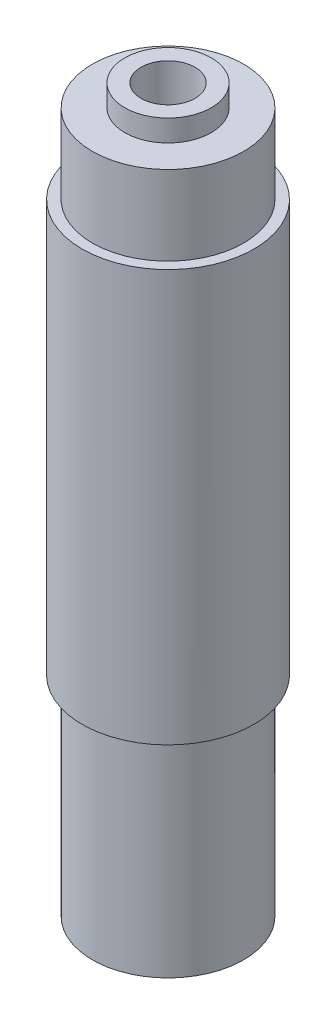
ISO-10303-21;
HEADER;
FILE_DESCRIPTION(('STEP AP214'),'2;1');
FILE_NAME('part.step','',(''),(''),'','','');
FILE_SCHEMA(('AUTOMOTIVE_DESIGN { 1 0 10303 214 1 1 1 1 }'));
ENDSEC;
DATA;
#1=APPLICATION_CONTEXT('core data for automotive mechanical design processes');
#2=APPLICATION_PROTOCOL_DEFINITION('international standard','automotive_design',2000,#1);
#3=PRODUCT_CONTEXT('',#1,'mechanical');
#4=PRODUCT('Part','Part','',(#3));
#5=PRODUCT_RELATED_PRODUCT_CATEGORY('part','',(#4));
#6=PRODUCT_DEFINITION_FORMATION('','',#4);
#7=PRODUCT_DEFINITION_CONTEXT('part definition',#1,'design');
#8=PRODUCT_DEFINITION('design','',#6,#7);
#9=PRODUCT_DEFINITION_SHAPE('','',#8);
#10=(LENGTH_UNIT() NAMED_UNIT(*) SI_UNIT(.MILLI.,.METRE.));
#11=(NAMED_UNIT(*) PLANE_ANGLE_UNIT() SI_UNIT($,.RADIAN.));
#12=(NAMED_UNIT(*) SI_UNIT($,.STERADIAN.) SOLID_ANGLE_UNIT());
#13=UNCERTAINTY_MEASURE_WITH_UNIT(LENGTH_MEASURE(1.E-05),#10,'distance_accuracy_value','');
#14=(GEOMETRIC_REPRESENTATION_CONTEXT(3) GLOBAL_UNCERTAINTY_ASSIGNED_CONTEXT((#13)) GLOBAL_UNIT_ASSIGNED_CONTEXT((#10,
#11,#12)) REPRESENTATION_CONTEXT('',''));
#15=CARTESIAN_POINT('',(0.,0.,0.));
#16=DIRECTION('',(0.,0.,1.));
#17=DIRECTION('',(1.,0.,0.));
#18=AXIS2_PLACEMENT_3D('',#15,#16,#17);
#19=CARTESIAN_POINT('',(0.,-17.2,0.));
#20=DIRECTION('',(0.,1.,0.));
#21=DIRECTION('',(0.,0.,1.));
#22=AXIS2_PLACEMENT_3D('',#19,#20,#21);
#23=PLANE('',#22);
#24=CARTESIAN_POINT('',(0.,-17.2,0.));
#25=DIRECTION('',(0.,1.,0.));
#26=DIRECTION('',(0.,0.,1.));
#27=AXIS2_PLACEMENT_3D('',#24,#25,#26);
#28=CIRCLE('',#27,1.24999999999999);
#29=CARTESIAN_POINT('',(0.,-17.2,1.24999999999999));
#30=VERTEX_POINT('',#29);
#31=EDGE_CURVE('E10',#30,#30,#28,.T.);
#32=ORIENTED_EDGE('',*,*,#31,.T.);
#33=EDGE_LOOP('',(#32));
#34=FACE_BOUND('',#33,.T.);
#35=CARTESIAN_POINT('',(0.,-17.2,0.));
#36=DIRECTION('',(0.,-1.,0.));
#37=DIRECTION('',(0.,0.,-1.));
#38=AXIS2_PLACEMENT_3D('',#35,#36,#37);
#39=CIRCLE('',#38,2.);
#40=CARTESIAN_POINT('',(0.,-17.2,-2.));
#41=VERTEX_POINT('',#40);
#42=EDGE_CURVE('E76',#41,#41,#39,.T.);
#43=ORIENTED_EDGE('',*,*,#42,.T.);
#44=EDGE_LOOP('',(#43));
#45=FACE_BOUND('',#44,.T.);
#46=ADVANCED_FACE('F37',(#34,#45),#23,.F.);
#47=CARTESIAN_POINT('',(0.,-6.525,0.));
#48=DIRECTION('',(0.,-1.,0.));
#49=DIRECTION('',(0.,0.,-1.));
#50=AXIS2_PLACEMENT_3D('',#47,#48,#49);
#51=CYLINDRICAL_SURFACE('',#50,3.5);
#52=CARTESIAN_POINT('',(0.,-6.525,0.));
#53=DIRECTION('',(0.,-1.,0.));
#54=DIRECTION('',(0.,0.,-1.));
#55=AXIS2_PLACEMENT_3D('',#52,#53,#54);
#56=CIRCLE('',#55,3.5);
#57=CARTESIAN_POINT('',(0.,-6.525,-3.5));
#58=VERTEX_POINT('',#57);
#59=EDGE_CURVE('E69',#58,#58,#56,.T.);
#60=ORIENTED_EDGE('',*,*,#59,.T.);
#61=EDGE_LOOP('',(#60));
#62=FACE_BOUND('',#61,.T.);
#63=CARTESIAN_POINT('',(0.,-16.2,0.));
#64=DIRECTION('',(0.,-1.,0.));
#65=DIRECTION('',(0.,0.,-1.));
#66=AXIS2_PLACEMENT_3D('',#63,#64,#65);
#67=CIRCLE('',#66,3.5);
#68=CARTESIAN_POINT('',(0.,-16.2,-3.5));
#69=VERTEX_POINT('',#68);
#70=EDGE_CURVE('E72',#69,#69,#67,.T.);
#71=ORIENTED_EDGE('',*,*,#70,.F.);
#72=EDGE_LOOP('',(#71));
#73=FACE_BOUND('',#72,.T.);
#74=ADVANCED_FACE('F92',(#62,#73),#51,.T.);
#75=CARTESIAN_POINT('',(0.,17.2,0.));
#76=DIRECTION('',(0.,-1.,0.));
#77=DIRECTION('',(0.,0.,-1.));
#78=AXIS2_PLACEMENT_3D('',#75,#76,#77);
#79=CYLINDRICAL_SURFACE('',#78,3.9751);
#80=CARTESIAN_POINT('',(0.,12.525,0.));
#81=DIRECTION('',(0.,1.,0.));
#82=DIRECTION('',(0.,0.,1.));
#83=AXIS2_PLACEMENT_3D('',#80,#81,#82);
#84=CIRCLE('',#83,3.9751);
#85=CARTESIAN_POINT('',(0.,12.525,3.9751));
#86=VERTEX_POINT('',#85);
#87=EDGE_CURVE('E48',#86,#86,#84,.T.);
#88=ORIENTED_EDGE('',*,*,#87,.F.);
#89=EDGE_LOOP('',(#88));
#90=FACE_BOUND('',#89,.T.);
#91=CARTESIAN_POINT('',(0.,-6.525,0.));
#92=DIRECTION('',(0.,-1.,0.));
#93=DIRECTION('',(0.,0.,-1.));
#94=AXIS2_PLACEMENT_3D('',#91,#92,#93);
#95=CIRCLE('',#94,3.9751);
#96=CARTESIAN_POINT('',(0.,-6.525,-3.9751));
#97=VERTEX_POINT('',#96);
#98=EDGE_CURVE('E62',#97,#97,#95,.T.);
#99=ORIENTED_EDGE('',*,*,#98,.F.);
#100=EDGE_LOOP('',(#99));
#101=FACE_BOUND('',#100,.T.);
#102=ADVANCED_FACE('F39',(#90,#101),#79,.T.);
#103=CARTESIAN_POINT('',(0.,17.2,0.));
#104=DIRECTION('',(0.,1.,0.));
#105=DIRECTION('',(0.,0.,1.));
#106=AXIS2_PLACEMENT_3D('',#103,#104,#105);
#107=PLANE('',#106);
#108=CARTESIAN_POINT('',(0.,17.2,0.));
#109=DIRECTION('',(0.,1.,0.));
#110=DIRECTION('',(0.,0.,1.));
#111=AXIS2_PLACEMENT_3D('',#108,#109,#110);
#112=CIRCLE('',#111,1.25);
#113=CARTESIAN_POINT('',(0.,17.2,1.25));
#114=VERTEX_POINT('',#113);
#115=EDGE_CURVE('E44',#114,#114,#112,.T.);
#116=ORIENTED_EDGE('',*,*,#115,.F.);
#117=EDGE_LOOP('',(#116));
#118=FACE_BOUND('',#117,.T.);
#119=CARTESIAN_POINT('',(0.,17.2,0.));
#120=DIRECTION('',(0.,1.,0.));
#121=DIRECTION('',(0.,0.,1.));
#122=AXIS2_PLACEMENT_3D('',#119,#120,#121);
#123=CIRCLE('',#122,2.);
#124=CARTESIAN_POINT('',(0.,17.2,2.));
#125=VERTEX_POINT('',#124);
#126=EDGE_CURVE('E58',#125,#125,#123,.T.);
#127=ORIENTED_EDGE('',*,*,#126,.T.);
#128=EDGE_LOOP('',(#127));
#129=FACE_BOUND('',#128,.T.);
#130=ADVANCED_FACE('F100',(#118,#129),#107,.T.);
#131=CARTESIAN_POINT('',(0.,12.525,0.));
#132=DIRECTION('',(0.,1.,0.));
#133=DIRECTION('',(0.,0.,1.));
#134=AXIS2_PLACEMENT_3D('',#131,#132,#133);
#135=CYLINDRICAL_SURFACE('',#134,3.5);
#136=CARTESIAN_POINT('',(0.,12.525,0.));
#137=DIRECTION('',(0.,1.,0.));
#138=DIRECTION('',(0.,0.,1.));
#139=AXIS2_PLACEMENT_3D('',#136,#137,#138);
#140=CIRCLE('',#139,3.5);
#141=CARTESIAN_POINT('',(0.,12.525,3.5));
#142=VERTEX_POINT('',#141);
#143=EDGE_CURVE('E52',#142,#142,#140,.T.);
#144=ORIENTED_EDGE('',*,*,#143,.T.);
#145=EDGE_LOOP('',(#144));
#146=FACE_BOUND('',#145,.T.);
#147=CARTESIAN_POINT('',(0.,16.2,0.));
#148=DIRECTION('',(0.,1.,0.));
#149=DIRECTION('',(0.,0.,1.));
#150=AXIS2_PLACEMENT_3D('',#147,#148,#149);
#151=CIRCLE('',#150,3.5);
#152=CARTESIAN_POINT('',(0.,16.2,3.5));
#153=VERTEX_POINT('',#152);
#154=EDGE_CURVE('E57',#153,#153,#151,.T.);
#155=ORIENTED_EDGE('',*,*,#154,.F.);
#156=EDGE_LOOP('',(#155));
#157=FACE_BOUND('',#156,.T.);
#158=ADVANCED_FACE('F113',(#146,#157),#135,.T.);
#159=CARTESIAN_POINT('',(0.,17.2,0.));
#160=DIRECTION('',(0.,1.,0.));
#161=DIRECTION('',(0.,0.,1.));
#162=AXIS2_PLACEMENT_3D('',#159,#160,#161);
#163=CYLINDRICAL_SURFACE('',#162,1.24999999999999);
#164=ORIENTED_EDGE('',*,*,#31,.F.);
#165=EDGE_LOOP('',(#164));
#166=FACE_BOUND('',#165,.T.);
#167=ORIENTED_EDGE('',*,*,#115,.T.);
#168=EDGE_LOOP('',(#167));
#169=FACE_BOUND('',#168,.T.);
#170=ADVANCED_FACE('F116',(#166,#169),#163,.F.);
#171=CARTESIAN_POINT('',(0.,12.525,0.));
#172=DIRECTION('',(0.,1.,0.));
#173=DIRECTION('',(0.,0.,1.));
#174=AXIS2_PLACEMENT_3D('',#171,#172,#173);
#175=PLANE('',#174);
#176=ORIENTED_EDGE('',*,*,#143,.F.);
#177=EDGE_LOOP('',(#176));
#178=FACE_BOUND('',#177,.T.);
#179=ORIENTED_EDGE('',*,*,#87,.T.);
#180=EDGE_LOOP('',(#179));
#181=FACE_BOUND('',#180,.T.);
#182=ADVANCED_FACE('F111',(#178,#181),#175,.T.);
#183=CARTESIAN_POINT('',(0.,16.2,0.));
#184=DIRECTION('',(0.,1.,0.));
#185=DIRECTION('',(0.,0.,1.));
#186=AXIS2_PLACEMENT_3D('',#183,#184,#185);
#187=CYLINDRICAL_SURFACE('',#186,2.);
#188=CARTESIAN_POINT('',(0.,16.2,0.));
#189=DIRECTION('',(0.,1.,0.));
#190=DIRECTION('',(0.,0.,1.));
#191=AXIS2_PLACEMENT_3D('',#188,#189,#190);
#192=CIRCLE('',#191,2.);
#193=CARTESIAN_POINT('',(0.,16.2,2.));
#194=VERTEX_POINT('',#193);
#195=EDGE_CURVE('E61',#194,#194,#192,.T.);
#196=ORIENTED_EDGE('',*,*,#195,.T.);
#197=EDGE_LOOP('',(#196));
#198=FACE_BOUND('',#197,.T.);
#199=ORIENTED_EDGE('',*,*,#126,.F.);
#200=EDGE_LOOP('',(#199));
#201=FACE_BOUND('',#200,.T.);
#202=ADVANCED_FACE('F107',(#198,#201),#187,.T.);
#203=CARTESIAN_POINT('',(0.,16.2,0.));
#204=DIRECTION('',(0.,1.,0.));
#205=DIRECTION('',(0.,0.,1.));
#206=AXIS2_PLACEMENT_3D('',#203,#204,#205);
#207=PLANE('',#206);
#208=ORIENTED_EDGE('',*,*,#195,.F.);
#209=EDGE_LOOP('',(#208));
#210=FACE_BOUND('',#209,.T.);
#211=ORIENTED_EDGE('',*,*,#154,.T.);
#212=EDGE_LOOP('',(#211));
#213=FACE_BOUND('',#212,.T.);
#214=ADVANCED_FACE('F104',(#210,#213),#207,.T.);
#215=CARTESIAN_POINT('',(0.,-6.525,0.));
#216=DIRECTION('',(0.,-1.,0.));
#217=DIRECTION('',(0.,0.,-1.));
#218=AXIS2_PLACEMENT_3D('',#215,#216,#217);
#219=PLANE('',#218);
#220=ORIENTED_EDGE('',*,*,#59,.F.);
#221=EDGE_LOOP('',(#220));
#222=FACE_BOUND('',#221,.T.);
#223=ORIENTED_EDGE('',*,*,#98,.T.);
#224=EDGE_LOOP('',(#223));
#225=FACE_BOUND('',#224,.T.);
#226=ADVANCED_FACE('F88',(#222,#225),#219,.T.);
#227=CARTESIAN_POINT('',(0.,-16.2,0.));
#228=DIRECTION('',(0.,-1.,0.));
#229=DIRECTION('',(0.,0.,-1.));
#230=AXIS2_PLACEMENT_3D('',#227,#228,#229);
#231=PLANE('',#230);
#232=CARTESIAN_POINT('',(0.,-16.2,0.));
#233=DIRECTION('',(0.,-1.,0.));
#234=DIRECTION('',(0.,0.,-1.));
#235=AXIS2_PLACEMENT_3D('',#232,#233,#234);
#236=CIRCLE('',#235,2.);
#237=CARTESIAN_POINT('',(0.,-16.2,-2.));
#238=VERTEX_POINT('',#237);
#239=EDGE_CURVE('E75',#238,#238,#236,.T.);
#240=ORIENTED_EDGE('',*,*,#239,.F.);
#241=EDGE_LOOP('',(#240));
#242=FACE_BOUND('',#241,.T.);
#243=ORIENTED_EDGE('',*,*,#70,.T.);
#244=EDGE_LOOP('',(#243));
#245=FACE_BOUND('',#244,.T.);
#246=ADVANCED_FACE('F85',(#242,#245),#231,.T.);
#247=CARTESIAN_POINT('',(0.,-16.2,0.));
#248=DIRECTION('',(0.,-1.,0.));
#249=DIRECTION('',(0.,0.,-1.));
#250=AXIS2_PLACEMENT_3D('',#247,#248,#249);
#251=CYLINDRICAL_SURFACE('',#250,2.);
#252=ORIENTED_EDGE('',*,*,#239,.T.);
#253=EDGE_LOOP('',(#252));
#254=FACE_BOUND('',#253,.T.);
#255=ORIENTED_EDGE('',*,*,#42,.F.);
#256=EDGE_LOOP('',(#255));
#257=FACE_BOUND('',#256,.T.);
#258=ADVANCED_FACE('F82',(#254,#257),#251,.T.);
#259=CLOSED_SHELL('',(#46,#74,#102,#130,#158,#170,#182,#202,#214,#226,#246,#258));
#260=MANIFOLD_SOLID_BREP('B2',#259);
#261=ADVANCED_BREP_SHAPE_REPRESENTATION('',(#18,#260),#14);
#262=SHAPE_DEFINITION_REPRESENTATION(#9,#261);
ENDSEC;
END-ISO-10303-21;
